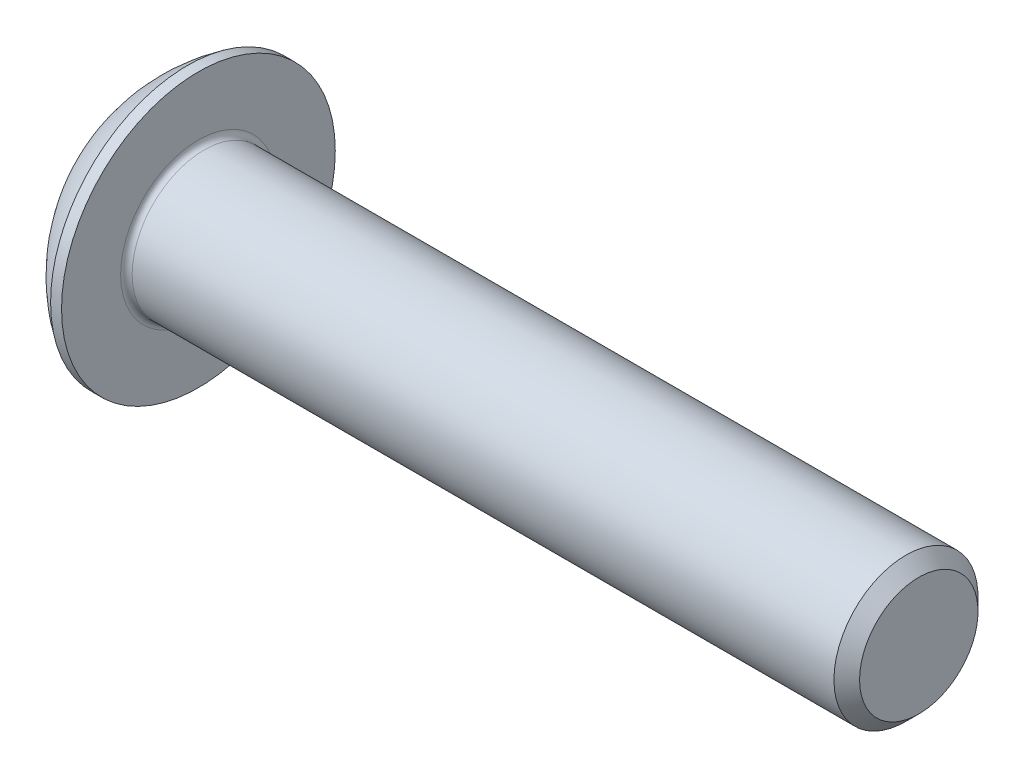
ISO-10303-21;
HEADER;
FILE_DESCRIPTION(('STEP AP214'),'2;1');
FILE_NAME('part.step','',(''),(''),'','','');
FILE_SCHEMA(('AUTOMOTIVE_DESIGN { 1 0 10303 214 1 1 1 1 }'));
ENDSEC;
DATA;
#1=APPLICATION_CONTEXT('core data for automotive mechanical design processes');
#2=APPLICATION_PROTOCOL_DEFINITION('international standard','automotive_design',2000,#1);
#3=PRODUCT_CONTEXT('',#1,'mechanical');
#4=PRODUCT('Part','Part','',(#3));
#5=PRODUCT_RELATED_PRODUCT_CATEGORY('part','',(#4));
#6=PRODUCT_DEFINITION_FORMATION('','',#4);
#7=PRODUCT_DEFINITION_CONTEXT('part definition',#1,'design');
#8=PRODUCT_DEFINITION('design','',#6,#7);
#9=PRODUCT_DEFINITION_SHAPE('','',#8);
#10=(LENGTH_UNIT() NAMED_UNIT(*) SI_UNIT(.MILLI.,.METRE.));
#11=(NAMED_UNIT(*) PLANE_ANGLE_UNIT() SI_UNIT($,.RADIAN.));
#12=(NAMED_UNIT(*) SI_UNIT($,.STERADIAN.) SOLID_ANGLE_UNIT());
#13=UNCERTAINTY_MEASURE_WITH_UNIT(LENGTH_MEASURE(1.E-05),#10,'distance_accuracy_value','');
#14=(GEOMETRIC_REPRESENTATION_CONTEXT(3) GLOBAL_UNCERTAINTY_ASSIGNED_CONTEXT((#13)) GLOBAL_UNIT_ASSIGNED_CONTEXT((#10,
#11,#12)) REPRESENTATION_CONTEXT('',''));
#15=CARTESIAN_POINT('',(0.,0.,0.));
#16=DIRECTION('',(0.,0.,1.));
#17=DIRECTION('',(1.,0.,0.));
#18=AXIS2_PLACEMENT_3D('',#15,#16,#17);
#19=CARTESIAN_POINT('',(5.51661919831224,0.,0.));
#20=DIRECTION('',(-1.,0.,0.));
#21=DIRECTION('',(0.,1.,0.));
#22=AXIS2_PLACEMENT_3D('',#19,#20,#21);
#23=SPHERICAL_SURFACE('',#22,5.69769360172932);
#24=CARTESIAN_POINT('',(2.37,0.,0.));
#25=DIRECTION('',(-1.,0.,0.));
#26=DIRECTION('',(0.,0.,1.));
#27=AXIS2_PLACEMENT_3D('',#24,#25,#26);
#28=CIRCLE('',#27,4.75);
#29=CARTESIAN_POINT('',(2.37,0.,4.75));
#30=VERTEX_POINT('',#29);
#31=EDGE_CURVE('E123',#30,#30,#28,.T.);
#32=ORIENTED_EDGE('',*,*,#31,.T.);
#33=EDGE_LOOP('',(#32));
#34=FACE_BOUND('',#33,.T.);
#35=CARTESIAN_POINT('',(5.51661919831224,0.,2.));
#36=DIRECTION('',(0.,0.,-1.));
#37=DIRECTION('',(-1.,0.,0.));
#38=AXIS2_PLACEMENT_3D('',#35,#36,#37);
#39=CIRCLE('',#38,5.33513939641573);
#40=CARTESIAN_POINT('',(0.276035988478895,0.999999999999999,2.));
#41=VERTEX_POINT('',#40);
#42=CARTESIAN_POINT('',(0.276035988478895,-0.999999999999998,2.));
#43=VERTEX_POINT('',#42);
#44=EDGE_CURVE('E11',#41,#43,#39,.F.);
#45=ORIENTED_EDGE('',*,*,#44,.T.);
#46=CARTESIAN_POINT('',(5.51661919831224,-0.999999999999999,0.));
#47=DIRECTION('',(0.,1.,0.));
#48=DIRECTION('',(0.,0.,1.));
#49=AXIS2_PLACEMENT_3D('',#46,#47,#48);
#50=CIRCLE('',#49,5.60925239039813);
#51=CARTESIAN_POINT('',(0.0199190628503128,-1.,1.11803398874989));
#52=VERTEX_POINT('',#51);
#53=EDGE_CURVE('E106',#43,#52,#50,.F.);
#54=ORIENTED_EDGE('',*,*,#53,.T.);
#55=CARTESIAN_POINT('',(0.0199190628503128,0.,0.));
#56=DIRECTION('',(1.,0.,0.));
#57=DIRECTION('',(0.,0.,-1.));
#58=AXIS2_PLACEMENT_3D('',#55,#56,#57);
#59=CIRCLE('',#58,1.5);
#60=CARTESIAN_POINT('',(0.0199190628503128,0.999999999999998,1.1180339887499));
#61=VERTEX_POINT('',#60);
#62=EDGE_CURVE('E113',#52,#61,#59,.T.);
#63=ORIENTED_EDGE('',*,*,#62,.T.);
#64=CARTESIAN_POINT('',(5.51661919831224,0.999999999999998,0.));
#65=DIRECTION('',(0.,-1.,0.));
#66=DIRECTION('',(0.,0.,-1.));
#67=AXIS2_PLACEMENT_3D('',#64,#65,#66);
#68=CIRCLE('',#67,5.60925239039813);
#69=EDGE_CURVE('E101',#61,#41,#68,.F.);
#70=ORIENTED_EDGE('',*,*,#69,.T.);
#71=EDGE_LOOP('',(#45,#54,#63,#70));
#72=FACE_BOUND('',#71,.T.);
#73=ADVANCED_FACE('F37',(#34,#72),#23,.T.);
#74=CARTESIAN_POINT('',(0.,0.,0.));
#75=DIRECTION('',(-1.,0.,0.));
#76=DIRECTION('',(0.,0.,1.));
#77=AXIS2_PLACEMENT_3D('',#74,#75,#76);
#78=CYLINDRICAL_SURFACE('',#77,1.5);
#79=ORIENTED_EDGE('',*,*,#62,.F.);
#80=DIRECTION('',(-1.,0.,0.));
#81=VECTOR('',#80,1.);
#82=CARTESIAN_POINT('',(0.,-1.,1.11803398874989));
#83=LINE('',#82,#81);
#84=CARTESIAN_POINT('',(1.56,-0.999999999999999,1.1180339887499));
#85=VERTEX_POINT('',#84);
#86=EDGE_CURVE('E103',#52,#85,#83,.F.);
#87=ORIENTED_EDGE('',*,*,#86,.T.);
#88=CARTESIAN_POINT('',(1.56,0.,0.));
#89=DIRECTION('',(-1.,0.,0.));
#90=DIRECTION('',(0.,0.,1.));
#91=AXIS2_PLACEMENT_3D('',#88,#89,#90);
#92=CIRCLE('',#91,1.5);
#93=CARTESIAN_POINT('',(1.56,0.999999999999998,1.1180339887499));
#94=VERTEX_POINT('',#93);
#95=EDGE_CURVE('E110',#94,#85,#92,.T.);
#96=ORIENTED_EDGE('',*,*,#95,.F.);
#97=DIRECTION('',(-1.,0.,0.));
#98=VECTOR('',#97,1.);
#99=CARTESIAN_POINT('',(0.,0.999999999999998,1.1180339887499));
#100=LINE('',#99,#98);
#101=EDGE_CURVE('E82',#94,#61,#100,.T.);
#102=ORIENTED_EDGE('',*,*,#101,.T.);
#103=EDGE_LOOP('',(#79,#87,#96,#102));
#104=FACE_BOUND('',#103,.T.);
#105=ADVANCED_FACE('F134',(#104),#78,.F.);
#106=CARTESIAN_POINT('',(0.,0.,0.));
#107=DIRECTION('',(-1.,0.,0.));
#108=DIRECTION('',(0.,0.,1.));
#109=AXIS2_PLACEMENT_3D('',#106,#107,#108);
#110=CYLINDRICAL_SURFACE('',#109,4.75);
#111=ORIENTED_EDGE('',*,*,#31,.F.);
#112=EDGE_LOOP('',(#111));
#113=FACE_BOUND('',#112,.T.);
#114=CARTESIAN_POINT('',(2.75,0.,0.));
#115=DIRECTION('',(-1.,0.,0.));
#116=DIRECTION('',(0.,0.,1.));
#117=AXIS2_PLACEMENT_3D('',#114,#115,#116);
#118=CIRCLE('',#117,4.75);
#119=CARTESIAN_POINT('',(2.75,0.,4.75));
#120=VERTEX_POINT('',#119);
#121=EDGE_CURVE('E120',#120,#120,#118,.T.);
#122=ORIENTED_EDGE('',*,*,#121,.T.);
#123=EDGE_LOOP('',(#122));
#124=FACE_BOUND('',#123,.T.);
#125=ADVANCED_FACE('F153',(#113,#124),#110,.T.);
#126=CARTESIAN_POINT('',(2.75,2.5,0.));
#127=DIRECTION('',(-1.,0.,0.));
#128=DIRECTION('',(0.,0.,1.));
#129=AXIS2_PLACEMENT_3D('',#126,#127,#128);
#130=PLANE('',#129);
#131=CARTESIAN_POINT('',(2.75,0.,0.));
#132=DIRECTION('',(-1.,0.,0.));
#133=DIRECTION('',(0.,0.,1.));
#134=AXIS2_PLACEMENT_3D('',#131,#132,#133);
#135=CIRCLE('',#134,2.7);
#136=CARTESIAN_POINT('',(2.75,0.,2.7));
#137=VERTEX_POINT('',#136);
#138=EDGE_CURVE('E126',#137,#137,#135,.T.);
#139=ORIENTED_EDGE('',*,*,#138,.T.);
#140=EDGE_LOOP('',(#139));
#141=FACE_BOUND('',#140,.T.);
#142=ORIENTED_EDGE('',*,*,#121,.F.);
#143=EDGE_LOOP('',(#142));
#144=FACE_BOUND('',#143,.T.);
#145=ADVANCED_FACE('F158',(#141,#144),#130,.F.);
#146=CARTESIAN_POINT('',(0.,0.,0.));
#147=DIRECTION('',(-1.,0.,0.));
#148=DIRECTION('',(0.,0.,1.));
#149=AXIS2_PLACEMENT_3D('',#146,#147,#148);
#150=CYLINDRICAL_SURFACE('',#149,2.5);
#151=CARTESIAN_POINT('',(2.95,0.,0.));
#152=DIRECTION('',(-1.,0.,0.));
#153=DIRECTION('',(0.,0.,1.));
#154=AXIS2_PLACEMENT_3D('',#151,#152,#153);
#155=CIRCLE('',#154,2.5);
#156=CARTESIAN_POINT('',(2.95,0.,2.5));
#157=VERTEX_POINT('',#156);
#158=EDGE_CURVE('E45',#157,#157,#155,.F.);
#159=ORIENTED_EDGE('',*,*,#158,.T.);
#160=EDGE_LOOP('',(#159));
#161=FACE_BOUND('',#160,.T.);
#162=CARTESIAN_POINT('',(27.305,0.,0.));
#163=DIRECTION('',(-1.,0.,0.));
#164=DIRECTION('',(0.,0.,1.));
#165=AXIS2_PLACEMENT_3D('',#162,#163,#164);
#166=CIRCLE('',#165,2.5);
#167=CARTESIAN_POINT('',(27.305,0.,2.5));
#168=VERTEX_POINT('',#167);
#169=EDGE_CURVE('E117',#168,#168,#166,.T.);
#170=ORIENTED_EDGE('',*,*,#169,.T.);
#171=EDGE_LOOP('',(#170));
#172=FACE_BOUND('',#171,.T.);
#173=ADVANCED_FACE('F162',(#161,#172),#150,.T.);
#174=CARTESIAN_POINT('',(27.75,0.,0.));
#175=DIRECTION('',(-1.,0.,0.));
#176=DIRECTION('',(0.,0.,1.));
#177=AXIS2_PLACEMENT_3D('',#174,#175,#176);
#178=CONICAL_SURFACE('',#177,2.055,0.785398163397432);
#179=ORIENTED_EDGE('',*,*,#169,.F.);
#180=EDGE_LOOP('',(#179));
#181=FACE_BOUND('',#180,.T.);
#182=CARTESIAN_POINT('',(27.75,0.,0.));
#183=DIRECTION('',(-1.,0.,0.));
#184=DIRECTION('',(0.,0.,1.));
#185=AXIS2_PLACEMENT_3D('',#182,#183,#184);
#186=CIRCLE('',#185,2.055);
#187=CARTESIAN_POINT('',(27.75,0.,2.055));
#188=VERTEX_POINT('',#187);
#189=EDGE_CURVE('E114',#188,#188,#186,.T.);
#190=ORIENTED_EDGE('',*,*,#189,.T.);
#191=EDGE_LOOP('',(#190));
#192=FACE_BOUND('',#191,.T.);
#193=ADVANCED_FACE('F166',(#181,#192),#178,.T.);
#194=CARTESIAN_POINT('',(27.75,0.,0.));
#195=DIRECTION('',(-1.,0.,0.));
#196=DIRECTION('',(0.,0.,1.));
#197=AXIS2_PLACEMENT_3D('',#194,#195,#196);
#198=PLANE('',#197);
#199=ORIENTED_EDGE('',*,*,#189,.F.);
#200=EDGE_LOOP('',(#199));
#201=FACE_BOUND('',#200,.T.);
#202=ADVANCED_FACE('F170',(#201),#198,.F.);
#203=CARTESIAN_POINT('',(2.95,0.,0.));
#204=DIRECTION('',(-1.,0.,0.));
#205=DIRECTION('',(0.,0.,1.));
#206=AXIS2_PLACEMENT_3D('',#203,#204,#205);
#207=TOROIDAL_SURFACE('',#206,2.7,0.2);
#208=ORIENTED_EDGE('',*,*,#158,.F.);
#209=EDGE_LOOP('',(#208));
#210=FACE_BOUND('',#209,.T.);
#211=ORIENTED_EDGE('',*,*,#138,.F.);
#212=EDGE_LOOP('',(#211));
#213=FACE_BOUND('',#212,.T.);
#214=ADVANCED_FACE('F39',(#210,#213),#207,.F.);
#215=CARTESIAN_POINT('',(2.42602540378445,0.,0.));
#216=DIRECTION('',(-1.,0.,0.));
#217=DIRECTION('',(0.,0.,1.));
#218=AXIS2_PLACEMENT_3D('',#215,#216,#217);
#219=CONICAL_SURFACE('',#218,0.,1.04719755119659);
#220=ORIENTED_EDGE('',*,*,#95,.T.);
#221=EDGE_CURVE('E109',#85,#94,#92,.T.);
#222=ORIENTED_EDGE('',*,*,#221,.T.);
#223=EDGE_LOOP('',(#220,#222));
#224=FACE_BOUND('',#223,.T.);
#225=CARTESIAN_POINT('',(2.42602540378445,0.,0.));
#226=VERTEX_POINT('',#225);
#227=VERTEX_LOOP('',#226);
#228=FACE_BOUND('',#227,.T.);
#229=ADVANCED_FACE('F137',(#224,#228),#219,.F.);
#230=CARTESIAN_POINT('',(1.56,-0.999999999999999,-1.));
#231=DIRECTION('',(0.,1.,0.));
#232=DIRECTION('',(0.,0.,1.));
#233=AXIS2_PLACEMENT_3D('',#230,#231,#232);
#234=PLANE('',#233);
#235=DIRECTION('',(-1.,0.,0.));
#236=VECTOR('',#235,1.);
#237=CARTESIAN_POINT('',(1.56,-0.999999999999999,2.));
#238=LINE('',#237,#236);
#239=CARTESIAN_POINT('',(1.56,-0.999999999999999,2.));
#240=VERTEX_POINT('',#239);
#241=EDGE_CURVE('E91',#240,#43,#238,.T.);
#242=ORIENTED_EDGE('',*,*,#241,.F.);
#243=DIRECTION('',(0.,0.,-1.));
#244=VECTOR('',#243,1.);
#245=CARTESIAN_POINT('',(1.56,-1.,0.));
#246=LINE('',#245,#244);
#247=EDGE_CURVE('E85',#240,#85,#246,.T.);
#248=ORIENTED_EDGE('',*,*,#247,.T.);
#249=ORIENTED_EDGE('',*,*,#86,.F.);
#250=ORIENTED_EDGE('',*,*,#53,.F.);
#251=EDGE_LOOP('',(#242,#248,#249,#250));
#252=FACE_BOUND('',#251,.T.);
#253=ADVANCED_FACE('F139',(#252),#234,.T.);
#254=CARTESIAN_POINT('',(1.56,0.999999999999999,2.));
#255=DIRECTION('',(0.,-1.,0.));
#256=DIRECTION('',(0.,0.,-1.));
#257=AXIS2_PLACEMENT_3D('',#254,#255,#256);
#258=PLANE('',#257);
#259=ORIENTED_EDGE('',*,*,#101,.F.);
#260=DIRECTION('',(0.,0.,1.));
#261=VECTOR('',#260,1.);
#262=CARTESIAN_POINT('',(1.56,0.999999999999999,0.));
#263=LINE('',#262,#261);
#264=CARTESIAN_POINT('',(1.56,0.999999999999999,2.));
#265=VERTEX_POINT('',#264);
#266=EDGE_CURVE('E52',#94,#265,#263,.T.);
#267=ORIENTED_EDGE('',*,*,#266,.T.);
#268=DIRECTION('',(-1.,0.,0.));
#269=VECTOR('',#268,1.);
#270=CARTESIAN_POINT('',(1.56,0.999999999999999,2.));
#271=LINE('',#270,#269);
#272=EDGE_CURVE('E79',#265,#41,#271,.T.);
#273=ORIENTED_EDGE('',*,*,#272,.T.);
#274=ORIENTED_EDGE('',*,*,#69,.F.);
#275=EDGE_LOOP('',(#259,#267,#273,#274));
#276=FACE_BOUND('',#275,.T.);
#277=ADVANCED_FACE('F78',(#276),#258,.T.);
#278=CARTESIAN_POINT('',(1.56,-0.999999999999999,2.));
#279=DIRECTION('',(0.,0.,-1.));
#280=DIRECTION('',(-1.,0.,0.));
#281=AXIS2_PLACEMENT_3D('',#278,#279,#280);
#282=PLANE('',#281);
#283=ORIENTED_EDGE('',*,*,#272,.F.);
#284=DIRECTION('',(0.,-1.,0.));
#285=VECTOR('',#284,1.);
#286=CARTESIAN_POINT('',(1.56,-0.999999999999999,2.));
#287=LINE('',#286,#285);
#288=EDGE_CURVE('E84',#265,#240,#287,.T.);
#289=ORIENTED_EDGE('',*,*,#288,.T.);
#290=ORIENTED_EDGE('',*,*,#241,.T.);
#291=ORIENTED_EDGE('',*,*,#44,.F.);
#292=EDGE_LOOP('',(#283,#289,#290,#291));
#293=FACE_BOUND('',#292,.T.);
#294=ADVANCED_FACE('F88',(#293),#282,.T.);
#295=CARTESIAN_POINT('',(1.56,-0.999999999999999,2.));
#296=DIRECTION('',(-1.,0.,0.));
#297=DIRECTION('',(0.,0.,1.));
#298=AXIS2_PLACEMENT_3D('',#295,#296,#297);
#299=PLANE('',#298);
#300=ORIENTED_EDGE('',*,*,#247,.F.);
#301=ORIENTED_EDGE('',*,*,#288,.F.);
#302=ORIENTED_EDGE('',*,*,#266,.F.);
#303=ORIENTED_EDGE('',*,*,#221,.F.);
#304=EDGE_LOOP('',(#300,#301,#302,#303));
#305=FACE_BOUND('',#304,.T.);
#306=ADVANCED_FACE('F94',(#305),#299,.T.);
#307=CLOSED_SHELL('',(#73,#105,#125,#145,#173,#193,#202,#214,#229,#253,#277,#294,#306));
#308=MANIFOLD_SOLID_BREP('B2',#307);
#309=ADVANCED_BREP_SHAPE_REPRESENTATION('',(#18,#308),#14);
#310=SHAPE_DEFINITION_REPRESENTATION(#9,#309);
ENDSEC;
END-ISO-10303-21;
